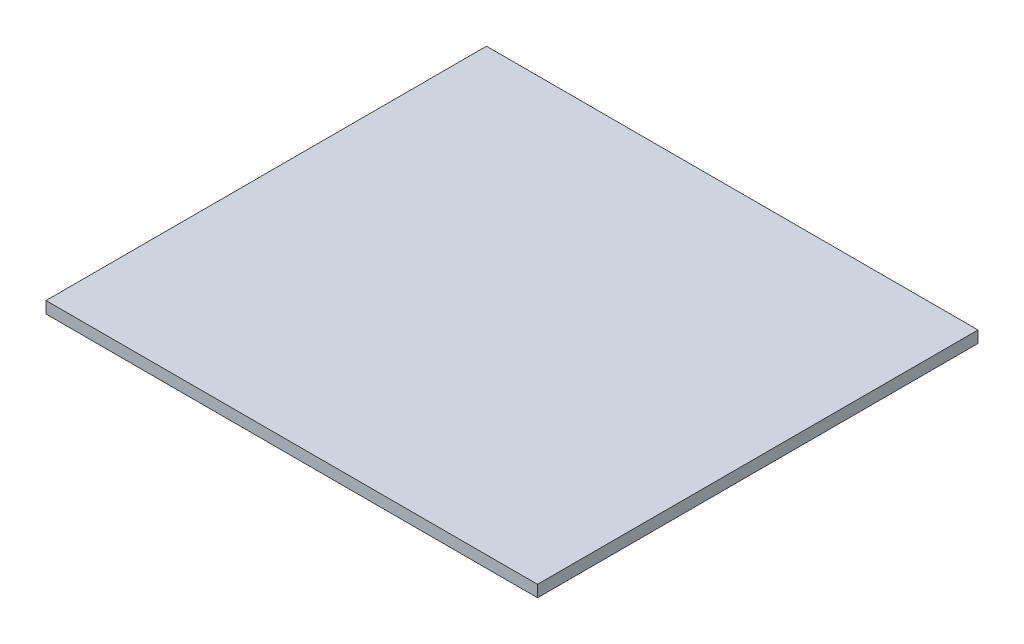
ISO-10303-21;
HEADER;
FILE_DESCRIPTION(('STEP AP214'),'2;1');
FILE_NAME('part.step','',(''),(''),'','','');
FILE_SCHEMA(('AUTOMOTIVE_DESIGN { 1 0 10303 214 1 1 1 1 }'));
ENDSEC;
DATA;
#1=APPLICATION_CONTEXT('core data for automotive mechanical design processes');
#2=APPLICATION_PROTOCOL_DEFINITION('international standard','automotive_design',2000,#1);
#3=PRODUCT_CONTEXT('',#1,'mechanical');
#4=PRODUCT('Part','Part','',(#3));
#5=PRODUCT_RELATED_PRODUCT_CATEGORY('part','',(#4));
#6=PRODUCT_DEFINITION_FORMATION('','',#4);
#7=PRODUCT_DEFINITION_CONTEXT('part definition',#1,'design');
#8=PRODUCT_DEFINITION('design','',#6,#7);
#9=PRODUCT_DEFINITION_SHAPE('','',#8);
#10=(LENGTH_UNIT() NAMED_UNIT(*) SI_UNIT(.MILLI.,.METRE.));
#11=(NAMED_UNIT(*) PLANE_ANGLE_UNIT() SI_UNIT($,.RADIAN.));
#12=(NAMED_UNIT(*) SI_UNIT($,.STERADIAN.) SOLID_ANGLE_UNIT());
#13=UNCERTAINTY_MEASURE_WITH_UNIT(LENGTH_MEASURE(1.E-05),#10,'distance_accuracy_value','');
#14=(GEOMETRIC_REPRESENTATION_CONTEXT(3) GLOBAL_UNCERTAINTY_ASSIGNED_CONTEXT((#13)) GLOBAL_UNIT_ASSIGNED_CONTEXT((#10,
#11,#12)) REPRESENTATION_CONTEXT('',''));
#15=CARTESIAN_POINT('',(0.,0.,0.));
#16=DIRECTION('',(0.,0.,1.));
#17=DIRECTION('',(1.,0.,0.));
#18=AXIS2_PLACEMENT_3D('',#15,#16,#17);
#19=CARTESIAN_POINT('',(3.175,329.819,-235.839));
#20=DIRECTION('',(1.,0.,0.));
#21=DIRECTION('',(0.,0.,-1.));
#22=AXIS2_PLACEMENT_3D('',#19,#20,#21);
#23=PLANE('',#22);
#24=DIRECTION('',(0.,-1.,0.));
#25=VECTOR('',#24,1.);
#26=CARTESIAN_POINT('',(3.175,329.819,-235.839));
#27=LINE('',#26,#25);
#28=CARTESIAN_POINT('',(3.17499999999997,3.17499999999998,-235.839));
#29=VERTEX_POINT('',#28);
#30=CARTESIAN_POINT('',(3.175,-3.175,-235.839));
#31=VERTEX_POINT('',#30);
#32=EDGE_CURVE('E11',#29,#31,#27,.T.);
#33=ORIENTED_EDGE('',*,*,#32,.F.);
#34=DIRECTION('',(0.,0.,1.));
#35=VECTOR('',#34,1.);
#36=CARTESIAN_POINT('',(3.17499999999997,3.17499999999998,-235.839));
#37=LINE('',#36,#35);
#38=CARTESIAN_POINT('',(3.17499999999997,3.17499999999998,3.175));
#39=VERTEX_POINT('',#38);
#40=EDGE_CURVE('E75',#29,#39,#37,.T.);
#41=ORIENTED_EDGE('',*,*,#40,.T.);
#42=DIRECTION('',(0.,-1.,0.));
#43=VECTOR('',#42,1.);
#44=CARTESIAN_POINT('',(3.17499999999997,329.819,3.175));
#45=LINE('',#44,#43);
#46=CARTESIAN_POINT('',(3.175,-3.175,3.175));
#47=VERTEX_POINT('',#46);
#48=EDGE_CURVE('E37',#39,#47,#45,.T.);
#49=ORIENTED_EDGE('',*,*,#48,.T.);
#50=DIRECTION('',(0.,0.,1.));
#51=VECTOR('',#50,1.);
#52=CARTESIAN_POINT('',(3.175,-3.175,3.175));
#53=LINE('',#52,#51);
#54=EDGE_CURVE('E89',#31,#47,#53,.T.);
#55=ORIENTED_EDGE('',*,*,#54,.F.);
#56=EDGE_LOOP('',(#33,#41,#49,#55));
#57=FACE_BOUND('',#56,.T.);
#58=ADVANCED_FACE('F33',(#57),#23,.T.);
#59=CARTESIAN_POINT('',(3.175,329.819,-235.839));
#60=DIRECTION('',(0.,0.,-1.));
#61=DIRECTION('',(-1.,0.,0.));
#62=AXIS2_PLACEMENT_3D('',#59,#60,#61);
#63=PLANE('',#62);
#64=DIRECTION('',(0.,-1.,0.));
#65=VECTOR('',#64,1.);
#66=CARTESIAN_POINT('',(-263.525,329.819,-235.839));
#67=LINE('',#66,#65);
#68=CARTESIAN_POINT('',(-263.525,3.17499999999998,-235.839));
#69=VERTEX_POINT('',#68);
#70=CARTESIAN_POINT('',(-263.525,-3.175,-235.839));
#71=VERTEX_POINT('',#70);
#72=EDGE_CURVE('E42',#69,#71,#67,.T.);
#73=ORIENTED_EDGE('',*,*,#72,.F.);
#74=DIRECTION('',(1.,0.,0.));
#75=VECTOR('',#74,1.);
#76=CARTESIAN_POINT('',(-263.525,3.17499999999998,-235.839));
#77=LINE('',#76,#75);
#78=EDGE_CURVE('E79',#69,#29,#77,.T.);
#79=ORIENTED_EDGE('',*,*,#78,.T.);
#80=ORIENTED_EDGE('',*,*,#32,.T.);
#81=DIRECTION('',(1.,0.,0.));
#82=VECTOR('',#81,1.);
#83=CARTESIAN_POINT('',(-263.525,-3.175,-235.839));
#84=LINE('',#83,#82);
#85=EDGE_CURVE('E101',#71,#31,#84,.T.);
#86=ORIENTED_EDGE('',*,*,#85,.F.);
#87=EDGE_LOOP('',(#73,#79,#80,#86));
#88=FACE_BOUND('',#87,.T.);
#89=ADVANCED_FACE('F102',(#88),#63,.T.);
#90=CARTESIAN_POINT('',(-263.525,329.819,-235.839));
#91=DIRECTION('',(-1.,0.,0.));
#92=DIRECTION('',(0.,0.,1.));
#93=AXIS2_PLACEMENT_3D('',#90,#91,#92);
#94=PLANE('',#93);
#95=DIRECTION('',(0.,-1.,0.));
#96=VECTOR('',#95,1.);
#97=CARTESIAN_POINT('',(-263.525,329.819,3.175));
#98=LINE('',#97,#96);
#99=CARTESIAN_POINT('',(-263.525,3.17499999999998,3.175));
#100=VERTEX_POINT('',#99);
#101=CARTESIAN_POINT('',(-263.525,-3.175,3.175));
#102=VERTEX_POINT('',#101);
#103=EDGE_CURVE('E57',#100,#102,#98,.T.);
#104=ORIENTED_EDGE('',*,*,#103,.F.);
#105=DIRECTION('',(0.,0.,1.));
#106=VECTOR('',#105,1.);
#107=CARTESIAN_POINT('',(-263.525,3.175,-229.489));
#108=LINE('',#107,#106);
#109=EDGE_CURVE('E50',#69,#100,#108,.T.);
#110=ORIENTED_EDGE('',*,*,#109,.F.);
#111=ORIENTED_EDGE('',*,*,#72,.T.);
#112=DIRECTION('',(0.,0.,-1.));
#113=VECTOR('',#112,1.);
#114=CARTESIAN_POINT('',(-263.525,-3.175,3.175));
#115=LINE('',#114,#113);
#116=EDGE_CURVE('E78',#102,#71,#115,.T.);
#117=ORIENTED_EDGE('',*,*,#116,.F.);
#118=EDGE_LOOP('',(#104,#110,#111,#117));
#119=FACE_BOUND('',#118,.T.);
#120=ADVANCED_FACE('F97',(#119),#94,.T.);
#121=CARTESIAN_POINT('',(3.17499999999997,329.819,3.175));
#122=DIRECTION('',(0.,0.,1.));
#123=DIRECTION('',(1.,0.,0.));
#124=AXIS2_PLACEMENT_3D('',#121,#122,#123);
#125=PLANE('',#124);
#126=ORIENTED_EDGE('',*,*,#48,.F.);
#127=DIRECTION('',(-1.,0.,0.));
#128=VECTOR('',#127,1.);
#129=CARTESIAN_POINT('',(-263.525,3.17499999999998,3.175));
#130=LINE('',#129,#128);
#131=EDGE_CURVE('E73',#39,#100,#130,.T.);
#132=ORIENTED_EDGE('',*,*,#131,.T.);
#133=ORIENTED_EDGE('',*,*,#103,.T.);
#134=DIRECTION('',(-1.,0.,0.));
#135=VECTOR('',#134,1.);
#136=CARTESIAN_POINT('',(-263.525,-3.175,3.175));
#137=LINE('',#136,#135);
#138=EDGE_CURVE('E87',#47,#102,#137,.T.);
#139=ORIENTED_EDGE('',*,*,#138,.F.);
#140=EDGE_LOOP('',(#126,#132,#133,#139));
#141=FACE_BOUND('',#140,.T.);
#142=ADVANCED_FACE('F86',(#141),#125,.T.);
#143=CARTESIAN_POINT('',(0.,3.175,0.));
#144=DIRECTION('',(0.,1.,0.));
#145=DIRECTION('',(0.,0.,1.));
#146=AXIS2_PLACEMENT_3D('',#143,#144,#145);
#147=PLANE('',#146);
#148=ORIENTED_EDGE('',*,*,#78,.F.);
#149=ORIENTED_EDGE('',*,*,#109,.T.);
#150=ORIENTED_EDGE('',*,*,#131,.F.);
#151=ORIENTED_EDGE('',*,*,#40,.F.);
#152=EDGE_LOOP('',(#148,#149,#150,#151));
#153=FACE_BOUND('',#152,.T.);
#154=ADVANCED_FACE('F35',(#153),#147,.T.);
#155=CARTESIAN_POINT('',(0.,-3.175,0.));
#156=DIRECTION('',(0.,-1.,0.));
#157=DIRECTION('',(0.,0.,-1.));
#158=AXIS2_PLACEMENT_3D('',#155,#156,#157);
#159=PLANE('',#158);
#160=ORIENTED_EDGE('',*,*,#116,.T.);
#161=ORIENTED_EDGE('',*,*,#85,.T.);
#162=ORIENTED_EDGE('',*,*,#54,.T.);
#163=ORIENTED_EDGE('',*,*,#138,.T.);
#164=EDGE_LOOP('',(#160,#161,#162,#163));
#165=FACE_BOUND('',#164,.T.);
#166=ADVANCED_FACE('F105',(#165),#159,.T.);
#167=CLOSED_SHELL('',(#58,#89,#120,#142,#154,#166));
#168=MANIFOLD_SOLID_BREP('B2',#167);
#169=ADVANCED_BREP_SHAPE_REPRESENTATION('',(#18,#168),#14);
#170=SHAPE_DEFINITION_REPRESENTATION(#9,#169);
ENDSEC;
END-ISO-10303-21;
